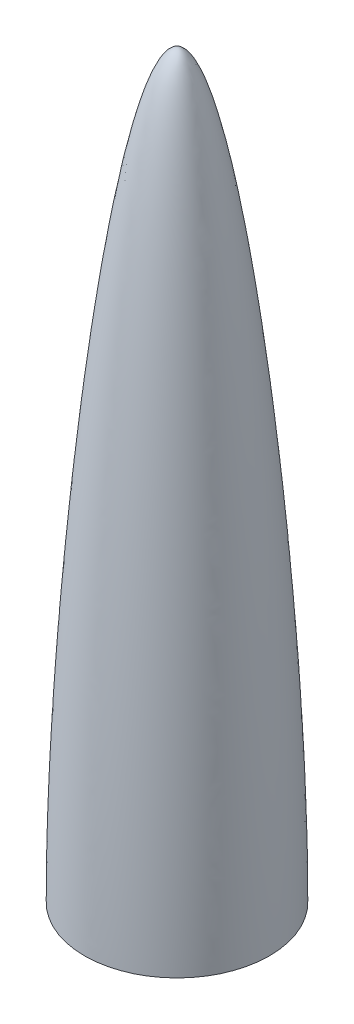
ISO-10303-21;
HEADER;
FILE_DESCRIPTION(('STEP AP214'),'2;1');
FILE_NAME('part.step','',(''),(''),'','','');
FILE_SCHEMA(('AUTOMOTIVE_DESIGN { 1 0 10303 214 1 1 1 1 }'));
ENDSEC;
DATA;
#1=APPLICATION_CONTEXT('core data for automotive mechanical design processes');
#2=APPLICATION_PROTOCOL_DEFINITION('international standard','automotive_design',2000,#1);
#3=PRODUCT_CONTEXT('',#1,'mechanical');
#4=PRODUCT('Part','Part','',(#3));
#5=PRODUCT_RELATED_PRODUCT_CATEGORY('part','',(#4));
#6=PRODUCT_DEFINITION_FORMATION('','',#4);
#7=PRODUCT_DEFINITION_CONTEXT('part definition',#1,'design');
#8=PRODUCT_DEFINITION('design','',#6,#7);
#9=PRODUCT_DEFINITION_SHAPE('','',#8);
#10=(LENGTH_UNIT() NAMED_UNIT(*) SI_UNIT(.MILLI.,.METRE.));
#11=(NAMED_UNIT(*) PLANE_ANGLE_UNIT() SI_UNIT($,.RADIAN.));
#12=(NAMED_UNIT(*) SI_UNIT($,.STERADIAN.) SOLID_ANGLE_UNIT());
#13=UNCERTAINTY_MEASURE_WITH_UNIT(LENGTH_MEASURE(1.E-05),#10,'distance_accuracy_value','');
#14=(GEOMETRIC_REPRESENTATION_CONTEXT(3) GLOBAL_UNCERTAINTY_ASSIGNED_CONTEXT((#13)) GLOBAL_UNIT_ASSIGNED_CONTEXT((#10,
#11,#12)) REPRESENTATION_CONTEXT('',''));
#15=CARTESIAN_POINT('',(0.,0.,0.));
#16=DIRECTION('',(0.,0.,1.));
#17=DIRECTION('',(1.,0.,0.));
#18=AXIS2_PLACEMENT_3D('',#15,#16,#17);
#19=CARTESIAN_POINT('',(4.1275,403.069458146955,0.));
#20=CARTESIAN_POINT('',(4.29202363713321,402.747413470771,0.));
#21=CARTESIAN_POINT('',(4.60563470180716,402.113699512921,0.));
#22=CARTESIAN_POINT('',(5.25902935705148,400.714319486589,0.));
#23=CARTESIAN_POINT('',(6.08052557233146,398.802814150954,0.));
#24=CARTESIAN_POINT('',(7.08012766076402,396.235904148973,0.));
#25=CARTESIAN_POINT('',(8.42081966262193,392.4721057004,0.));
#26=CARTESIAN_POINT('',(10.1053217106121,387.147151322801,0.));
#27=CARTESIAN_POINT('',(12.1235028418488,379.832445690583,0.));
#28=CARTESIAN_POINT('',(14.12884528873,371.651216829993,0.));
#29=CARTESIAN_POINT('',(16.7760228663702,359.660430734449,0.));
#30=CARTESIAN_POINT('',(20.0208705412657,342.773209039108,0.));
#31=CARTESIAN_POINT('',(23.7756069574677,319.87201384631,0.));
#32=CARTESIAN_POINT('',(27.3599431808325,294.724294429459,0.));
#33=CARTESIAN_POINT('',(30.7442314056049,267.71547718948,0.));
#34=CARTESIAN_POINT('',(33.8997186689304,239.228376580345,0.));
#35=CARTESIAN_POINT('',(36.7980675212827,209.644450358667,0.));
#36=CARTESIAN_POINT('',(39.4111777460924,179.344383779096,0.));
#37=CARTESIAN_POINT('',(41.7110865878509,148.708460892577,0.));
#38=CARTESIAN_POINT('',(43.669922699339,118.116805640907,0.));
#39=CARTESIAN_POINT('',(44.9948904247482,92.977467607808,0.));
#40=CARTESIAN_POINT('',(45.8565631571113,73.2684258988613,0.));
#41=CARTESIAN_POINT('',(46.4002098961938,58.7355322208369,0.));
#42=CARTESIAN_POINT('',(46.8377987892618,44.4989168954721,0.));
#43=CARTESIAN_POINT('',(47.1112048076291,32.9225396768806,0.));
#44=CARTESIAN_POINT('',(47.2734709517128,23.8560069142551,0.));
#45=CARTESIAN_POINT('',(47.3665007365304,17.1639997492888,0.));
#46=CARTESIAN_POINT('',(47.4304926424886,10.5670603563226,0.));
#47=CARTESIAN_POINT('',(47.4533698164017,6.28358059200904,0.));
#48=CARTESIAN_POINT('',(47.4599258416345,4.12750000000004,0.));
#49=B_SPLINE_CURVE_WITH_KNOTS('',3,(#19,#20,#21,#22,#23,#24,#25,#26,#27,#28,#29,#30,#31,#32,#33,
#34,#35,#36,#37,#38,#39,#40,#41,#42,#43,#44,#45,#46,#47,#48),.UNSPECIFIED.,.F.,.F.,(4,1,1,1,1,1,
1,1,1,1,1,1,1,1,1,1,1,1,1,1,1,1,1,1,1,1,1,4),(0.102456086431318,0.109397847786348,
0.116339609141378,0.130223131851438,0.144106654561499,0.157990177271559,0.18575722269168,
0.213524268111801,0.241291313531922,0.269058358952043,0.324592449792284,0.380126540632526,
0.435660631472768,0.491194722313009,0.546728813153251,0.602262903993492,0.657796994833734,
0.713331085673976,0.768865176514217,0.824399267354459,0.85216631277458,0.879933358194701,
0.907700403614822,0.935467449034942,0.949350971745003,0.963234494455063,0.977118017165124,
0.991001539875184),.UNSPECIFIED.);
#50=CARTESIAN_POINT('',(0.,433.3875,0.));
#51=DIRECTION('',(0.,1.,0.));
#52=AXIS1_PLACEMENT('',#50,#51);
#53=SURFACE_OF_REVOLUTION('',#49,#52);
#54=CARTESIAN_POINT('',(0.,4.12750000000006,0.));
#55=DIRECTION('',(0.,1.,0.));
#56=DIRECTION('',(0.,0.,1.));
#57=AXIS2_PLACEMENT_3D('',#54,#55,#56);
#58=CIRCLE('',#57,47.4599258416345);
#59=CARTESIAN_POINT('',(0.,4.12750000000006,47.4599258416345));
#60=VERTEX_POINT('',#59);
#61=EDGE_CURVE('E11',#60,#60,#58,.T.);
#62=ORIENTED_EDGE('',*,*,#61,.F.);
#63=EDGE_LOOP('',(#62));
#64=FACE_BOUND('',#63,.T.);
#65=CARTESIAN_POINT('',(0.,403.069458146955,0.));
#66=DIRECTION('',(0.,1.,0.));
#67=DIRECTION('',(0.,0.,1.));
#68=AXIS2_PLACEMENT_3D('',#65,#66,#67);
#69=CIRCLE('',#68,4.1275);
#70=CARTESIAN_POINT('',(0.,403.069458146955,4.1275));
#71=VERTEX_POINT('',#70);
#72=EDGE_CURVE('E58',#71,#71,#69,.T.);
#73=ORIENTED_EDGE('',*,*,#72,.T.);
#74=EDGE_LOOP('',(#73));
#75=FACE_BOUND('',#74,.T.);
#76=ADVANCED_FACE('F38',(#64,#75),#53,.T.);
#77=CARTESIAN_POINT('',(0.,433.3875,0.));
#78=DIRECTION('',(0.,1.,0.));
#79=DIRECTION('',(0.,0.,1.));
#80=AXIS2_PLACEMENT_3D('',#77,#78,#79);
#81=CYLINDRICAL_SURFACE('',#80,47.4599258416345);
#82=CARTESIAN_POINT('',(0.,0.,0.));
#83=DIRECTION('',(0.,1.,0.));
#84=DIRECTION('',(0.,0.,1.));
#85=AXIS2_PLACEMENT_3D('',#82,#83,#84);
#86=CIRCLE('',#85,47.4599258416345);
#87=CARTESIAN_POINT('',(0.,0.,47.4599258416345));
#88=VERTEX_POINT('',#87);
#89=EDGE_CURVE('E45',#88,#88,#86,.T.);
#90=ORIENTED_EDGE('',*,*,#89,.F.);
#91=EDGE_LOOP('',(#90));
#92=FACE_BOUND('',#91,.T.);
#93=ORIENTED_EDGE('',*,*,#61,.T.);
#94=EDGE_LOOP('',(#93));
#95=FACE_BOUND('',#94,.T.);
#96=ADVANCED_FACE('F76',(#92,#95),#81,.F.);
#97=CARTESIAN_POINT('',(47.4599258416345,0.,0.));
#98=DIRECTION('',(0.,1.,0.));
#99=DIRECTION('',(0.,0.,1.));
#100=AXIS2_PLACEMENT_3D('',#97,#98,#99);
#101=PLANE('',#100);
#102=CARTESIAN_POINT('',(0.,0.,0.));
#103=DIRECTION('',(0.,1.,0.));
#104=DIRECTION('',(0.,0.,1.));
#105=AXIS2_PLACEMENT_3D('',#102,#103,#104);
#106=CIRCLE('',#105,51.59375);
#107=CARTESIAN_POINT('',(0.,0.,51.59375));
#108=VERTEX_POINT('',#107);
#109=EDGE_CURVE('E56',#108,#108,#106,.T.);
#110=ORIENTED_EDGE('',*,*,#109,.F.);
#111=EDGE_LOOP('',(#110));
#112=FACE_BOUND('',#111,.T.);
#113=ORIENTED_EDGE('',*,*,#89,.T.);
#114=EDGE_LOOP('',(#113));
#115=FACE_BOUND('',#114,.T.);
#116=ADVANCED_FACE('F52',(#112,#115),#101,.F.);
#117=CARTESIAN_POINT('',(51.59375,0.,0.));
#118=CARTESIAN_POINT('',(51.59375,152.4,0.));
#119=CARTESIAN_POINT('',(25.4,412.75,0.));
#120=CARTESIAN_POINT('',(0.,412.75,0.));
#121=B_SPLINE_CURVE_WITH_KNOTS('',3,(#117,#118,#119,#120),.UNSPECIFIED.,.F.,.F.,(4,4),(0.,1.),.UNSPECIFIED.);
#122=CARTESIAN_POINT('',(0.,433.3875,0.));
#123=DIRECTION('',(0.,1.,0.));
#124=AXIS1_PLACEMENT('',#122,#123);
#125=SURFACE_OF_REVOLUTION('',#121,#124);
#126=CARTESIAN_POINT('',(0.,412.75,0.));
#127=VERTEX_POINT('',#126);
#128=VERTEX_LOOP('',#127);
#129=FACE_BOUND('',#128,.T.);
#130=ORIENTED_EDGE('',*,*,#109,.T.);
#131=EDGE_LOOP('',(#130));
#132=FACE_BOUND('',#131,.T.);
#133=ADVANCED_FACE('F48',(#129,#132),#125,.T.);
#134=CARTESIAN_POINT('',(4.1275,403.069458146955,0.));
#135=DIRECTION('',(0.,1.,0.));
#136=DIRECTION('',(0.,0.,1.));
#137=AXIS2_PLACEMENT_3D('',#134,#135,#136);
#138=PLANE('',#137);
#139=ORIENTED_EDGE('',*,*,#72,.F.);
#140=EDGE_LOOP('',(#139));
#141=FACE_BOUND('',#140,.T.);
#142=ADVANCED_FACE('F51',(#141),#138,.F.);
#143=CLOSED_SHELL('',(#76,#96,#116,#133,#142));
#144=MANIFOLD_SOLID_BREP('B2',#143);
#145=ADVANCED_BREP_SHAPE_REPRESENTATION('',(#18,#144),#14);
#146=SHAPE_DEFINITION_REPRESENTATION(#9,#145);
ENDSEC;
END-ISO-10303-21;
